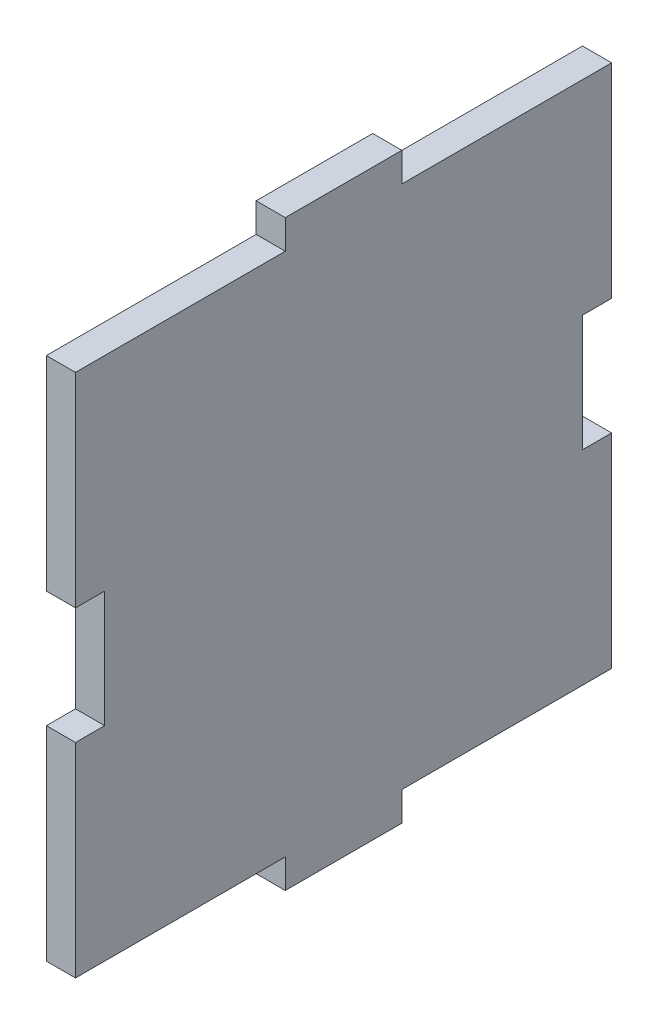
ISO-10303-21;
HEADER;
FILE_DESCRIPTION(('STEP AP214'),'2;1');
FILE_NAME('part.step','',(''),(''),'','','');
FILE_SCHEMA(('AUTOMOTIVE_DESIGN { 1 0 10303 214 1 1 1 1 }'));
ENDSEC;
DATA;
#1=APPLICATION_CONTEXT('core data for automotive mechanical design processes');
#2=APPLICATION_PROTOCOL_DEFINITION('international standard','automotive_design',2000,#1);
#3=PRODUCT_CONTEXT('',#1,'mechanical');
#4=PRODUCT('Part','Part','',(#3));
#5=PRODUCT_RELATED_PRODUCT_CATEGORY('part','',(#4));
#6=PRODUCT_DEFINITION_FORMATION('','',#4);
#7=PRODUCT_DEFINITION_CONTEXT('part definition',#1,'design');
#8=PRODUCT_DEFINITION('design','',#6,#7);
#9=PRODUCT_DEFINITION_SHAPE('','',#8);
#10=(LENGTH_UNIT() NAMED_UNIT(*) SI_UNIT(.MILLI.,.METRE.));
#11=(NAMED_UNIT(*) PLANE_ANGLE_UNIT() SI_UNIT($,.RADIAN.));
#12=(NAMED_UNIT(*) SI_UNIT($,.STERADIAN.) SOLID_ANGLE_UNIT());
#13=UNCERTAINTY_MEASURE_WITH_UNIT(LENGTH_MEASURE(1.E-05),#10,'distance_accuracy_value','');
#14=(GEOMETRIC_REPRESENTATION_CONTEXT(3) GLOBAL_UNCERTAINTY_ASSIGNED_CONTEXT((#13)) GLOBAL_UNIT_ASSIGNED_CONTEXT((#10,
#11,#12)) REPRESENTATION_CONTEXT('',''));
#15=CARTESIAN_POINT('',(0.,0.,0.));
#16=DIRECTION('',(0.,0.,1.));
#17=DIRECTION('',(1.,0.,0.));
#18=AXIS2_PLACEMENT_3D('',#15,#16,#17);
#19=CARTESIAN_POINT('',(3.175,6.35,29.21));
#20=DIRECTION('',(0.,0.,-1.));
#21=DIRECTION('',(-1.,0.,0.));
#22=AXIS2_PLACEMENT_3D('',#19,#20,#21);
#23=PLANE('',#22);
#24=DIRECTION('',(0.,-1.,0.));
#25=VECTOR('',#24,1.);
#26=CARTESIAN_POINT('',(0.,6.35,29.21));
#27=LINE('',#26,#25);
#28=CARTESIAN_POINT('',(0.,28.575,29.21));
#29=VERTEX_POINT('',#28);
#30=CARTESIAN_POINT('',(0.,6.35,29.21));
#31=VERTEX_POINT('',#30);
#32=EDGE_CURVE('E212',#29,#31,#27,.T.);
#33=ORIENTED_EDGE('',*,*,#32,.T.);
#34=DIRECTION('',(-1.,0.,0.));
#35=VECTOR('',#34,1.);
#36=CARTESIAN_POINT('',(3.175,6.35,29.21));
#37=LINE('',#36,#35);
#38=CARTESIAN_POINT('',(3.175,6.35,29.21));
#39=VERTEX_POINT('',#38);
#40=EDGE_CURVE('E11',#39,#31,#37,.T.);
#41=ORIENTED_EDGE('',*,*,#40,.F.);
#42=DIRECTION('',(0.,-1.,0.));
#43=VECTOR('',#42,1.);
#44=CARTESIAN_POINT('',(3.175,6.35,29.21));
#45=LINE('',#44,#43);
#46=CARTESIAN_POINT('',(3.175,28.575,29.21));
#47=VERTEX_POINT('',#46);
#48=EDGE_CURVE('E270',#47,#39,#45,.T.);
#49=ORIENTED_EDGE('',*,*,#48,.F.);
#50=DIRECTION('',(-1.,0.,0.));
#51=VECTOR('',#50,1.);
#52=CARTESIAN_POINT('',(3.175,28.575,29.21));
#53=LINE('',#52,#51);
#54=EDGE_CURVE('E208',#47,#29,#53,.T.);
#55=ORIENTED_EDGE('',*,*,#54,.T.);
#56=EDGE_LOOP('',(#33,#41,#49,#55));
#57=FACE_BOUND('',#56,.T.);
#58=ADVANCED_FACE('F39',(#57),#23,.F.);
#59=CARTESIAN_POINT('',(3.175,6.35,26.035));
#60=DIRECTION('',(0.,1.,0.));
#61=DIRECTION('',(0.,0.,1.));
#62=AXIS2_PLACEMENT_3D('',#59,#60,#61);
#63=PLANE('',#62);
#64=DIRECTION('',(0.,0.,-1.));
#65=VECTOR('',#64,1.);
#66=CARTESIAN_POINT('',(0.,6.35,26.035));
#67=LINE('',#66,#65);
#68=CARTESIAN_POINT('',(0.,6.35,26.035));
#69=VERTEX_POINT('',#68);
#70=EDGE_CURVE('E216',#31,#69,#67,.T.);
#71=ORIENTED_EDGE('',*,*,#70,.T.);
#72=DIRECTION('',(-1.,0.,0.));
#73=VECTOR('',#72,1.);
#74=CARTESIAN_POINT('',(3.175,6.35,26.035));
#75=LINE('',#74,#73);
#76=CARTESIAN_POINT('',(3.175,6.35,26.035));
#77=VERTEX_POINT('',#76);
#78=EDGE_CURVE('E48',#77,#69,#75,.T.);
#79=ORIENTED_EDGE('',*,*,#78,.F.);
#80=DIRECTION('',(0.,0.,-1.));
#81=VECTOR('',#80,1.);
#82=CARTESIAN_POINT('',(3.175,6.35,26.035));
#83=LINE('',#82,#81);
#84=EDGE_CURVE('E135',#39,#77,#83,.T.);
#85=ORIENTED_EDGE('',*,*,#84,.F.);
#86=ORIENTED_EDGE('',*,*,#40,.T.);
#87=EDGE_LOOP('',(#71,#79,#85,#86));
#88=FACE_BOUND('',#87,.T.);
#89=ADVANCED_FACE('F420',(#88),#63,.F.);
#90=CARTESIAN_POINT('',(3.175,-6.35,26.035));
#91=DIRECTION('',(0.,0.,-1.));
#92=DIRECTION('',(0.,1.,0.));
#93=AXIS2_PLACEMENT_3D('',#90,#91,#92);
#94=PLANE('',#93);
#95=DIRECTION('',(0.,-1.,0.));
#96=VECTOR('',#95,1.);
#97=CARTESIAN_POINT('',(0.,-6.35,26.035));
#98=LINE('',#97,#96);
#99=CARTESIAN_POINT('',(0.,-6.35,26.035));
#100=VERTEX_POINT('',#99);
#101=EDGE_CURVE('E219',#69,#100,#98,.T.);
#102=ORIENTED_EDGE('',*,*,#101,.T.);
#103=DIRECTION('',(-1.,0.,0.));
#104=VECTOR('',#103,1.);
#105=CARTESIAN_POINT('',(3.175,-6.35,26.035));
#106=LINE('',#105,#104);
#107=CARTESIAN_POINT('',(3.175,-6.35,26.035));
#108=VERTEX_POINT('',#107);
#109=EDGE_CURVE('E329',#108,#100,#106,.T.);
#110=ORIENTED_EDGE('',*,*,#109,.F.);
#111=DIRECTION('',(0.,-1.,0.));
#112=VECTOR('',#111,1.);
#113=CARTESIAN_POINT('',(3.175,-6.35,26.035));
#114=LINE('',#113,#112);
#115=EDGE_CURVE('E339',#77,#108,#114,.T.);
#116=ORIENTED_EDGE('',*,*,#115,.F.);
#117=ORIENTED_EDGE('',*,*,#78,.T.);
#118=EDGE_LOOP('',(#102,#110,#116,#117));
#119=FACE_BOUND('',#118,.T.);
#120=ADVANCED_FACE('F337',(#119),#94,.F.);
#121=CARTESIAN_POINT('',(3.175,-6.35,29.21));
#122=DIRECTION('',(0.,-1.,0.));
#123=DIRECTION('',(0.,0.,-1.));
#124=AXIS2_PLACEMENT_3D('',#121,#122,#123);
#125=PLANE('',#124);
#126=DIRECTION('',(0.,0.,1.));
#127=VECTOR('',#126,1.);
#128=CARTESIAN_POINT('',(0.,-6.35,29.21));
#129=LINE('',#128,#127);
#130=CARTESIAN_POINT('',(0.,-6.35,29.21));
#131=VERTEX_POINT('',#130);
#132=EDGE_CURVE('E222',#100,#131,#129,.T.);
#133=ORIENTED_EDGE('',*,*,#132,.T.);
#134=DIRECTION('',(-1.,0.,0.));
#135=VECTOR('',#134,1.);
#136=CARTESIAN_POINT('',(3.175,-6.35,29.21));
#137=LINE('',#136,#135);
#138=CARTESIAN_POINT('',(3.175,-6.35,29.21));
#139=VERTEX_POINT('',#138);
#140=EDGE_CURVE('E325',#139,#131,#137,.T.);
#141=ORIENTED_EDGE('',*,*,#140,.F.);
#142=DIRECTION('',(0.,0.,1.));
#143=VECTOR('',#142,1.);
#144=CARTESIAN_POINT('',(3.175,-6.35,29.21));
#145=LINE('',#144,#143);
#146=EDGE_CURVE('E358',#108,#139,#145,.T.);
#147=ORIENTED_EDGE('',*,*,#146,.F.);
#148=ORIENTED_EDGE('',*,*,#109,.T.);
#149=EDGE_LOOP('',(#133,#141,#147,#148));
#150=FACE_BOUND('',#149,.T.);
#151=ADVANCED_FACE('F348',(#150),#125,.F.);
#152=CARTESIAN_POINT('',(3.175,-28.575,29.21));
#153=DIRECTION('',(0.,0.,-1.));
#154=DIRECTION('',(-1.,0.,0.));
#155=AXIS2_PLACEMENT_3D('',#152,#153,#154);
#156=PLANE('',#155);
#157=DIRECTION('',(0.,-1.,0.));
#158=VECTOR('',#157,1.);
#159=CARTESIAN_POINT('',(0.,-28.575,29.21));
#160=LINE('',#159,#158);
#161=CARTESIAN_POINT('',(0.,-28.575,29.21));
#162=VERTEX_POINT('',#161);
#163=EDGE_CURVE('E225',#131,#162,#160,.T.);
#164=ORIENTED_EDGE('',*,*,#163,.T.);
#165=DIRECTION('',(-1.,0.,0.));
#166=VECTOR('',#165,1.);
#167=CARTESIAN_POINT('',(3.175,-28.575,29.21));
#168=LINE('',#167,#166);
#169=CARTESIAN_POINT('',(3.175,-28.575,29.21));
#170=VERTEX_POINT('',#169);
#171=EDGE_CURVE('E321',#170,#162,#168,.T.);
#172=ORIENTED_EDGE('',*,*,#171,.F.);
#173=DIRECTION('',(0.,-1.,0.));
#174=VECTOR('',#173,1.);
#175=CARTESIAN_POINT('',(3.175,-28.575,29.21));
#176=LINE('',#175,#174);
#177=EDGE_CURVE('E354',#139,#170,#176,.T.);
#178=ORIENTED_EDGE('',*,*,#177,.F.);
#179=ORIENTED_EDGE('',*,*,#140,.T.);
#180=EDGE_LOOP('',(#164,#172,#178,#179));
#181=FACE_BOUND('',#180,.T.);
#182=ADVANCED_FACE('F352',(#181),#156,.F.);
#183=CARTESIAN_POINT('',(3.175,-28.575,6.35000000000001));
#184=DIRECTION('',(0.,1.,0.));
#185=DIRECTION('',(0.,0.,1.));
#186=AXIS2_PLACEMENT_3D('',#183,#184,#185);
#187=PLANE('',#186);
#188=DIRECTION('',(0.,0.,-1.));
#189=VECTOR('',#188,1.);
#190=CARTESIAN_POINT('',(0.,-28.575,6.35000000000001));
#191=LINE('',#190,#189);
#192=CARTESIAN_POINT('',(0.,-28.575,6.35000000000001));
#193=VERTEX_POINT('',#192);
#194=EDGE_CURVE('E228',#162,#193,#191,.T.);
#195=ORIENTED_EDGE('',*,*,#194,.T.);
#196=DIRECTION('',(-1.,0.,0.));
#197=VECTOR('',#196,1.);
#198=CARTESIAN_POINT('',(3.175,-28.575,6.35000000000001));
#199=LINE('',#198,#197);
#200=CARTESIAN_POINT('',(3.175,-28.575,6.35000000000001));
#201=VERTEX_POINT('',#200);
#202=EDGE_CURVE('E317',#201,#193,#199,.T.);
#203=ORIENTED_EDGE('',*,*,#202,.F.);
#204=DIRECTION('',(0.,0.,-1.));
#205=VECTOR('',#204,1.);
#206=CARTESIAN_POINT('',(3.175,-28.575,6.35000000000001));
#207=LINE('',#206,#205);
#208=EDGE_CURVE('E357',#170,#201,#207,.T.);
#209=ORIENTED_EDGE('',*,*,#208,.F.);
#210=ORIENTED_EDGE('',*,*,#171,.T.);
#211=EDGE_LOOP('',(#195,#203,#209,#210));
#212=FACE_BOUND('',#211,.T.);
#213=ADVANCED_FACE('F433',(#212),#187,.F.);
#214=CARTESIAN_POINT('',(3.175,-31.75,6.35));
#215=DIRECTION('',(0.,0.,-1.));
#216=DIRECTION('',(0.,1.,0.));
#217=AXIS2_PLACEMENT_3D('',#214,#215,#216);
#218=PLANE('',#217);
#219=DIRECTION('',(0.,-1.,0.));
#220=VECTOR('',#219,1.);
#221=CARTESIAN_POINT('',(0.,-31.75,6.35));
#222=LINE('',#221,#220);
#223=CARTESIAN_POINT('',(0.,-31.75,6.35));
#224=VERTEX_POINT('',#223);
#225=EDGE_CURVE('E231',#193,#224,#222,.T.);
#226=ORIENTED_EDGE('',*,*,#225,.T.);
#227=DIRECTION('',(-1.,0.,0.));
#228=VECTOR('',#227,1.);
#229=CARTESIAN_POINT('',(3.175,-31.75,6.35));
#230=LINE('',#229,#228);
#231=CARTESIAN_POINT('',(3.175,-31.75,6.35));
#232=VERTEX_POINT('',#231);
#233=EDGE_CURVE('E313',#232,#224,#230,.T.);
#234=ORIENTED_EDGE('',*,*,#233,.F.);
#235=DIRECTION('',(0.,-1.,0.));
#236=VECTOR('',#235,1.);
#237=CARTESIAN_POINT('',(3.175,-31.75,6.35));
#238=LINE('',#237,#236);
#239=EDGE_CURVE('E362',#201,#232,#238,.T.);
#240=ORIENTED_EDGE('',*,*,#239,.F.);
#241=ORIENTED_EDGE('',*,*,#202,.T.);
#242=EDGE_LOOP('',(#226,#234,#240,#241));
#243=FACE_BOUND('',#242,.T.);
#244=ADVANCED_FACE('F436',(#243),#218,.F.);
#245=CARTESIAN_POINT('',(3.175,-31.75,-6.35));
#246=DIRECTION('',(0.,1.,0.));
#247=DIRECTION('',(0.,0.,1.));
#248=AXIS2_PLACEMENT_3D('',#245,#246,#247);
#249=PLANE('',#248);
#250=DIRECTION('',(0.,0.,-1.));
#251=VECTOR('',#250,1.);
#252=CARTESIAN_POINT('',(0.,-31.75,-6.35));
#253=LINE('',#252,#251);
#254=CARTESIAN_POINT('',(0.,-31.75,-6.35));
#255=VERTEX_POINT('',#254);
#256=EDGE_CURVE('E234',#224,#255,#253,.T.);
#257=ORIENTED_EDGE('',*,*,#256,.T.);
#258=DIRECTION('',(-1.,0.,0.));
#259=VECTOR('',#258,1.);
#260=CARTESIAN_POINT('',(3.175,-31.75,-6.35));
#261=LINE('',#260,#259);
#262=CARTESIAN_POINT('',(3.175,-31.75,-6.35));
#263=VERTEX_POINT('',#262);
#264=EDGE_CURVE('E309',#263,#255,#261,.T.);
#265=ORIENTED_EDGE('',*,*,#264,.F.);
#266=DIRECTION('',(0.,0.,-1.));
#267=VECTOR('',#266,1.);
#268=CARTESIAN_POINT('',(3.175,-31.75,-6.35));
#269=LINE('',#268,#267);
#270=EDGE_CURVE('E369',#232,#263,#269,.T.);
#271=ORIENTED_EDGE('',*,*,#270,.F.);
#272=ORIENTED_EDGE('',*,*,#233,.T.);
#273=EDGE_LOOP('',(#257,#265,#271,#272));
#274=FACE_BOUND('',#273,.T.);
#275=ADVANCED_FACE('F440',(#274),#249,.F.);
#276=CARTESIAN_POINT('',(3.175,-28.575,-6.35000000000001));
#277=DIRECTION('',(0.,0.,1.));
#278=DIRECTION('',(0.,-1.,0.));
#279=AXIS2_PLACEMENT_3D('',#276,#277,#278);
#280=PLANE('',#279);
#281=DIRECTION('',(0.,1.,0.));
#282=VECTOR('',#281,1.);
#283=CARTESIAN_POINT('',(0.,-28.575,-6.35000000000001));
#284=LINE('',#283,#282);
#285=CARTESIAN_POINT('',(0.,-28.575,-6.35000000000001));
#286=VERTEX_POINT('',#285);
#287=EDGE_CURVE('E237',#255,#286,#284,.T.);
#288=ORIENTED_EDGE('',*,*,#287,.T.);
#289=DIRECTION('',(-1.,0.,0.));
#290=VECTOR('',#289,1.);
#291=CARTESIAN_POINT('',(3.175,-28.575,-6.35000000000001));
#292=LINE('',#291,#290);
#293=CARTESIAN_POINT('',(3.175,-28.575,-6.35000000000001));
#294=VERTEX_POINT('',#293);
#295=EDGE_CURVE('E305',#294,#286,#292,.T.);
#296=ORIENTED_EDGE('',*,*,#295,.F.);
#297=DIRECTION('',(0.,1.,0.));
#298=VECTOR('',#297,1.);
#299=CARTESIAN_POINT('',(3.175,-28.575,-6.35000000000001));
#300=LINE('',#299,#298);
#301=EDGE_CURVE('E372',#263,#294,#300,.T.);
#302=ORIENTED_EDGE('',*,*,#301,.F.);
#303=ORIENTED_EDGE('',*,*,#264,.T.);
#304=EDGE_LOOP('',(#288,#296,#302,#303));
#305=FACE_BOUND('',#304,.T.);
#306=ADVANCED_FACE('F444',(#305),#280,.F.);
#307=CARTESIAN_POINT('',(3.175,-28.575,-29.21));
#308=DIRECTION('',(0.,1.,0.));
#309=DIRECTION('',(0.,0.,1.));
#310=AXIS2_PLACEMENT_3D('',#307,#308,#309);
#311=PLANE('',#310);
#312=DIRECTION('',(0.,0.,-1.));
#313=VECTOR('',#312,1.);
#314=CARTESIAN_POINT('',(0.,-28.575,-29.21));
#315=LINE('',#314,#313);
#316=CARTESIAN_POINT('',(0.,-28.575,-29.21));
#317=VERTEX_POINT('',#316);
#318=EDGE_CURVE('E240',#286,#317,#315,.T.);
#319=ORIENTED_EDGE('',*,*,#318,.T.);
#320=DIRECTION('',(-1.,0.,0.));
#321=VECTOR('',#320,1.);
#322=CARTESIAN_POINT('',(3.175,-28.575,-29.21));
#323=LINE('',#322,#321);
#324=CARTESIAN_POINT('',(3.175,-28.575,-29.21));
#325=VERTEX_POINT('',#324);
#326=EDGE_CURVE('E301',#325,#317,#323,.T.);
#327=ORIENTED_EDGE('',*,*,#326,.F.);
#328=DIRECTION('',(0.,0.,-1.));
#329=VECTOR('',#328,1.);
#330=CARTESIAN_POINT('',(3.175,-28.575,-29.21));
#331=LINE('',#330,#329);
#332=EDGE_CURVE('E375',#294,#325,#331,.T.);
#333=ORIENTED_EDGE('',*,*,#332,.F.);
#334=ORIENTED_EDGE('',*,*,#295,.T.);
#335=EDGE_LOOP('',(#319,#327,#333,#334));
#336=FACE_BOUND('',#335,.T.);
#337=ADVANCED_FACE('F448',(#336),#311,.F.);
#338=CARTESIAN_POINT('',(3.175,-6.35,-29.21));
#339=DIRECTION('',(0.,0.,1.));
#340=DIRECTION('',(1.,0.,0.));
#341=AXIS2_PLACEMENT_3D('',#338,#339,#340);
#342=PLANE('',#341);
#343=DIRECTION('',(0.,1.,0.));
#344=VECTOR('',#343,1.);
#345=CARTESIAN_POINT('',(0.,-6.35,-29.21));
#346=LINE('',#345,#344);
#347=CARTESIAN_POINT('',(0.,-6.35,-29.21));
#348=VERTEX_POINT('',#347);
#349=EDGE_CURVE('E243',#317,#348,#346,.T.);
#350=ORIENTED_EDGE('',*,*,#349,.T.);
#351=DIRECTION('',(-1.,0.,0.));
#352=VECTOR('',#351,1.);
#353=CARTESIAN_POINT('',(3.175,-6.35,-29.21));
#354=LINE('',#353,#352);
#355=CARTESIAN_POINT('',(3.175,-6.35,-29.21));
#356=VERTEX_POINT('',#355);
#357=EDGE_CURVE('E297',#356,#348,#354,.T.);
#358=ORIENTED_EDGE('',*,*,#357,.F.);
#359=DIRECTION('',(0.,1.,0.));
#360=VECTOR('',#359,1.);
#361=CARTESIAN_POINT('',(3.175,-6.35,-29.21));
#362=LINE('',#361,#360);
#363=EDGE_CURVE('E378',#325,#356,#362,.T.);
#364=ORIENTED_EDGE('',*,*,#363,.F.);
#365=ORIENTED_EDGE('',*,*,#326,.T.);
#366=EDGE_LOOP('',(#350,#358,#364,#365));
#367=FACE_BOUND('',#366,.T.);
#368=ADVANCED_FACE('F452',(#367),#342,.F.);
#369=CARTESIAN_POINT('',(3.175,-6.35,-26.035));
#370=DIRECTION('',(0.,-1.,0.));
#371=DIRECTION('',(0.,0.,-1.));
#372=AXIS2_PLACEMENT_3D('',#369,#370,#371);
#373=PLANE('',#372);
#374=DIRECTION('',(0.,0.,1.));
#375=VECTOR('',#374,1.);
#376=CARTESIAN_POINT('',(0.,-6.35,-26.035));
#377=LINE('',#376,#375);
#378=CARTESIAN_POINT('',(0.,-6.35,-26.035));
#379=VERTEX_POINT('',#378);
#380=EDGE_CURVE('E246',#348,#379,#377,.T.);
#381=ORIENTED_EDGE('',*,*,#380,.T.);
#382=DIRECTION('',(-1.,0.,0.));
#383=VECTOR('',#382,1.);
#384=CARTESIAN_POINT('',(3.175,-6.35,-26.035));
#385=LINE('',#384,#383);
#386=CARTESIAN_POINT('',(3.175,-6.35,-26.035));
#387=VERTEX_POINT('',#386);
#388=EDGE_CURVE('E293',#387,#379,#385,.T.);
#389=ORIENTED_EDGE('',*,*,#388,.F.);
#390=DIRECTION('',(0.,0.,1.));
#391=VECTOR('',#390,1.);
#392=CARTESIAN_POINT('',(3.175,-6.35,-26.035));
#393=LINE('',#392,#391);
#394=EDGE_CURVE('E381',#356,#387,#393,.T.);
#395=ORIENTED_EDGE('',*,*,#394,.F.);
#396=ORIENTED_EDGE('',*,*,#357,.T.);
#397=EDGE_LOOP('',(#381,#389,#395,#396));
#398=FACE_BOUND('',#397,.T.);
#399=ADVANCED_FACE('F456',(#398),#373,.F.);
#400=CARTESIAN_POINT('',(3.175,6.35,-26.035));
#401=DIRECTION('',(0.,0.,1.));
#402=DIRECTION('',(0.,-1.,0.));
#403=AXIS2_PLACEMENT_3D('',#400,#401,#402);
#404=PLANE('',#403);
#405=DIRECTION('',(0.,1.,0.));
#406=VECTOR('',#405,1.);
#407=CARTESIAN_POINT('',(0.,6.35,-26.035));
#408=LINE('',#407,#406);
#409=CARTESIAN_POINT('',(0.,6.35,-26.035));
#410=VERTEX_POINT('',#409);
#411=EDGE_CURVE('E249',#379,#410,#408,.T.);
#412=ORIENTED_EDGE('',*,*,#411,.T.);
#413=DIRECTION('',(-1.,0.,0.));
#414=VECTOR('',#413,1.);
#415=CARTESIAN_POINT('',(3.175,6.35,-26.035));
#416=LINE('',#415,#414);
#417=CARTESIAN_POINT('',(3.175,6.35,-26.035));
#418=VERTEX_POINT('',#417);
#419=EDGE_CURVE('E289',#418,#410,#416,.T.);
#420=ORIENTED_EDGE('',*,*,#419,.F.);
#421=DIRECTION('',(0.,1.,0.));
#422=VECTOR('',#421,1.);
#423=CARTESIAN_POINT('',(3.175,6.35,-26.035));
#424=LINE('',#423,#422);
#425=EDGE_CURVE('E384',#387,#418,#424,.T.);
#426=ORIENTED_EDGE('',*,*,#425,.F.);
#427=ORIENTED_EDGE('',*,*,#388,.T.);
#428=EDGE_LOOP('',(#412,#420,#426,#427));
#429=FACE_BOUND('',#428,.T.);
#430=ADVANCED_FACE('F460',(#429),#404,.F.);
#431=CARTESIAN_POINT('',(3.175,6.35,-29.21));
#432=DIRECTION('',(0.,1.,0.));
#433=DIRECTION('',(0.,0.,1.));
#434=AXIS2_PLACEMENT_3D('',#431,#432,#433);
#435=PLANE('',#434);
#436=DIRECTION('',(0.,0.,-1.));
#437=VECTOR('',#436,1.);
#438=CARTESIAN_POINT('',(0.,6.35,-29.21));
#439=LINE('',#438,#437);
#440=CARTESIAN_POINT('',(0.,6.35,-29.21));
#441=VERTEX_POINT('',#440);
#442=EDGE_CURVE('E252',#410,#441,#439,.T.);
#443=ORIENTED_EDGE('',*,*,#442,.T.);
#444=DIRECTION('',(-1.,0.,0.));
#445=VECTOR('',#444,1.);
#446=CARTESIAN_POINT('',(3.175,6.35,-29.21));
#447=LINE('',#446,#445);
#448=CARTESIAN_POINT('',(3.175,6.35,-29.21));
#449=VERTEX_POINT('',#448);
#450=EDGE_CURVE('E285',#449,#441,#447,.T.);
#451=ORIENTED_EDGE('',*,*,#450,.F.);
#452=DIRECTION('',(0.,0.,-1.));
#453=VECTOR('',#452,1.);
#454=CARTESIAN_POINT('',(3.175,6.35,-29.21));
#455=LINE('',#454,#453);
#456=EDGE_CURVE('E387',#418,#449,#455,.T.);
#457=ORIENTED_EDGE('',*,*,#456,.F.);
#458=ORIENTED_EDGE('',*,*,#419,.T.);
#459=EDGE_LOOP('',(#443,#451,#457,#458));
#460=FACE_BOUND('',#459,.T.);
#461=ADVANCED_FACE('F464',(#460),#435,.F.);
#462=CARTESIAN_POINT('',(3.175,28.575,-29.21));
#463=DIRECTION('',(0.,0.,1.));
#464=DIRECTION('',(1.,0.,0.));
#465=AXIS2_PLACEMENT_3D('',#462,#463,#464);
#466=PLANE('',#465);
#467=DIRECTION('',(0.,1.,0.));
#468=VECTOR('',#467,1.);
#469=CARTESIAN_POINT('',(0.,28.575,-29.21));
#470=LINE('',#469,#468);
#471=CARTESIAN_POINT('',(0.,28.575,-29.21));
#472=VERTEX_POINT('',#471);
#473=EDGE_CURVE('E255',#441,#472,#470,.T.);
#474=ORIENTED_EDGE('',*,*,#473,.T.);
#475=DIRECTION('',(-1.,0.,0.));
#476=VECTOR('',#475,1.);
#477=CARTESIAN_POINT('',(3.175,28.575,-29.21));
#478=LINE('',#477,#476);
#479=CARTESIAN_POINT('',(3.175,28.575,-29.21));
#480=VERTEX_POINT('',#479);
#481=EDGE_CURVE('E281',#480,#472,#478,.T.);
#482=ORIENTED_EDGE('',*,*,#481,.F.);
#483=DIRECTION('',(0.,1.,0.));
#484=VECTOR('',#483,1.);
#485=CARTESIAN_POINT('',(3.175,28.575,-29.21));
#486=LINE('',#485,#484);
#487=EDGE_CURVE('E390',#449,#480,#486,.T.);
#488=ORIENTED_EDGE('',*,*,#487,.F.);
#489=ORIENTED_EDGE('',*,*,#450,.T.);
#490=EDGE_LOOP('',(#474,#482,#488,#489));
#491=FACE_BOUND('',#490,.T.);
#492=ADVANCED_FACE('F468',(#491),#466,.F.);
#493=CARTESIAN_POINT('',(3.175,28.575,-6.35000000000001));
#494=DIRECTION('',(0.,-1.,0.));
#495=DIRECTION('',(0.,0.,-1.));
#496=AXIS2_PLACEMENT_3D('',#493,#494,#495);
#497=PLANE('',#496);
#498=DIRECTION('',(0.,0.,1.));
#499=VECTOR('',#498,1.);
#500=CARTESIAN_POINT('',(0.,28.575,-6.35000000000001));
#501=LINE('',#500,#499);
#502=CARTESIAN_POINT('',(0.,28.575,-6.35000000000001));
#503=VERTEX_POINT('',#502);
#504=EDGE_CURVE('E258',#472,#503,#501,.T.);
#505=ORIENTED_EDGE('',*,*,#504,.T.);
#506=DIRECTION('',(-1.,0.,0.));
#507=VECTOR('',#506,1.);
#508=CARTESIAN_POINT('',(3.175,28.575,-6.35000000000001));
#509=LINE('',#508,#507);
#510=CARTESIAN_POINT('',(3.175,28.575,-6.35000000000001));
#511=VERTEX_POINT('',#510);
#512=EDGE_CURVE('E277',#511,#503,#509,.T.);
#513=ORIENTED_EDGE('',*,*,#512,.F.);
#514=DIRECTION('',(0.,0.,1.));
#515=VECTOR('',#514,1.);
#516=CARTESIAN_POINT('',(3.175,28.575,-6.35000000000001));
#517=LINE('',#516,#515);
#518=EDGE_CURVE('E393',#480,#511,#517,.T.);
#519=ORIENTED_EDGE('',*,*,#518,.F.);
#520=ORIENTED_EDGE('',*,*,#481,.T.);
#521=EDGE_LOOP('',(#505,#513,#519,#520));
#522=FACE_BOUND('',#521,.T.);
#523=ADVANCED_FACE('F401',(#522),#497,.F.);
#524=CARTESIAN_POINT('',(3.175,31.75,-6.35));
#525=DIRECTION('',(0.,0.,1.));
#526=DIRECTION('',(0.,-1.,0.));
#527=AXIS2_PLACEMENT_3D('',#524,#525,#526);
#528=PLANE('',#527);
#529=DIRECTION('',(0.,1.,0.));
#530=VECTOR('',#529,1.);
#531=CARTESIAN_POINT('',(0.,31.75,-6.35));
#532=LINE('',#531,#530);
#533=CARTESIAN_POINT('',(0.,31.75,-6.35));
#534=VERTEX_POINT('',#533);
#535=EDGE_CURVE('E261',#503,#534,#532,.T.);
#536=ORIENTED_EDGE('',*,*,#535,.T.);
#537=DIRECTION('',(-1.,0.,0.));
#538=VECTOR('',#537,1.);
#539=CARTESIAN_POINT('',(3.175,31.75,-6.35));
#540=LINE('',#539,#538);
#541=CARTESIAN_POINT('',(3.175,31.75,-6.35));
#542=VERTEX_POINT('',#541);
#543=EDGE_CURVE('E201',#542,#534,#540,.T.);
#544=ORIENTED_EDGE('',*,*,#543,.F.);
#545=DIRECTION('',(0.,1.,0.));
#546=VECTOR('',#545,1.);
#547=CARTESIAN_POINT('',(3.175,31.75,-6.35));
#548=LINE('',#547,#546);
#549=EDGE_CURVE('E190',#511,#542,#548,.T.);
#550=ORIENTED_EDGE('',*,*,#549,.F.);
#551=ORIENTED_EDGE('',*,*,#512,.T.);
#552=EDGE_LOOP('',(#536,#544,#550,#551));
#553=FACE_BOUND('',#552,.T.);
#554=ADVANCED_FACE('F405',(#553),#528,.F.);
#555=CARTESIAN_POINT('',(3.175,31.75,6.35));
#556=DIRECTION('',(0.,-1.,0.));
#557=DIRECTION('',(0.,0.,-1.));
#558=AXIS2_PLACEMENT_3D('',#555,#556,#557);
#559=PLANE('',#558);
#560=DIRECTION('',(0.,0.,1.));
#561=VECTOR('',#560,1.);
#562=CARTESIAN_POINT('',(0.,31.75,6.35));
#563=LINE('',#562,#561);
#564=CARTESIAN_POINT('',(0.,31.75,6.35));
#565=VERTEX_POINT('',#564);
#566=EDGE_CURVE('E199',#534,#565,#563,.T.);
#567=ORIENTED_EDGE('',*,*,#566,.T.);
#568=DIRECTION('',(-1.,0.,0.));
#569=VECTOR('',#568,1.);
#570=CARTESIAN_POINT('',(3.175,31.75,6.35));
#571=LINE('',#570,#569);
#572=CARTESIAN_POINT('',(3.175,31.75,6.35));
#573=VERTEX_POINT('',#572);
#574=EDGE_CURVE('E196',#573,#565,#571,.T.);
#575=ORIENTED_EDGE('',*,*,#574,.F.);
#576=DIRECTION('',(0.,0.,1.));
#577=VECTOR('',#576,1.);
#578=CARTESIAN_POINT('',(3.175,31.75,6.35));
#579=LINE('',#578,#577);
#580=EDGE_CURVE('E184',#542,#573,#579,.T.);
#581=ORIENTED_EDGE('',*,*,#580,.F.);
#582=ORIENTED_EDGE('',*,*,#543,.T.);
#583=EDGE_LOOP('',(#567,#575,#581,#582));
#584=FACE_BOUND('',#583,.T.);
#585=ADVANCED_FACE('F197',(#584),#559,.F.);
#586=CARTESIAN_POINT('',(3.175,28.575,6.35000000000001));
#587=DIRECTION('',(0.,0.,-1.));
#588=DIRECTION('',(0.,1.,0.));
#589=AXIS2_PLACEMENT_3D('',#586,#587,#588);
#590=PLANE('',#589);
#591=DIRECTION('',(0.,-1.,0.));
#592=VECTOR('',#591,1.);
#593=CARTESIAN_POINT('',(0.,28.575,6.35000000000001));
#594=LINE('',#593,#592);
#595=CARTESIAN_POINT('',(0.,28.575,6.35000000000001));
#596=VERTEX_POINT('',#595);
#597=EDGE_CURVE('E121',#565,#596,#594,.T.);
#598=ORIENTED_EDGE('',*,*,#597,.T.);
#599=DIRECTION('',(-1.,0.,0.));
#600=VECTOR('',#599,1.);
#601=CARTESIAN_POINT('',(3.175,28.575,6.35000000000001));
#602=LINE('',#601,#600);
#603=CARTESIAN_POINT('',(3.175,28.575,6.35000000000001));
#604=VERTEX_POINT('',#603);
#605=EDGE_CURVE('E202',#604,#596,#602,.T.);
#606=ORIENTED_EDGE('',*,*,#605,.F.);
#607=DIRECTION('',(0.,-1.,0.));
#608=VECTOR('',#607,1.);
#609=CARTESIAN_POINT('',(3.175,28.575,6.35000000000001));
#610=LINE('',#609,#608);
#611=EDGE_CURVE('E188',#573,#604,#610,.T.);
#612=ORIENTED_EDGE('',*,*,#611,.F.);
#613=ORIENTED_EDGE('',*,*,#574,.T.);
#614=EDGE_LOOP('',(#598,#606,#612,#613));
#615=FACE_BOUND('',#614,.T.);
#616=ADVANCED_FACE('F204',(#615),#590,.F.);
#617=CARTESIAN_POINT('',(3.175,28.575,29.21));
#618=DIRECTION('',(0.,-1.,0.));
#619=DIRECTION('',(0.,0.,-1.));
#620=AXIS2_PLACEMENT_3D('',#617,#618,#619);
#621=PLANE('',#620);
#622=DIRECTION('',(0.,0.,1.));
#623=VECTOR('',#622,1.);
#624=CARTESIAN_POINT('',(0.,28.575,29.21));
#625=LINE('',#624,#623);
#626=EDGE_CURVE('E127',#596,#29,#625,.T.);
#627=ORIENTED_EDGE('',*,*,#626,.T.);
#628=ORIENTED_EDGE('',*,*,#54,.F.);
#629=DIRECTION('',(0.,0.,1.));
#630=VECTOR('',#629,1.);
#631=CARTESIAN_POINT('',(3.175,28.575,29.21));
#632=LINE('',#631,#630);
#633=EDGE_CURVE('E56',#604,#47,#632,.T.);
#634=ORIENTED_EDGE('',*,*,#633,.F.);
#635=ORIENTED_EDGE('',*,*,#605,.T.);
#636=EDGE_LOOP('',(#627,#628,#634,#635));
#637=FACE_BOUND('',#636,.T.);
#638=ADVANCED_FACE('F409',(#637),#621,.F.);
#639=CARTESIAN_POINT('',(3.175,0.,0.));
#640=DIRECTION('',(-1.,0.,0.));
#641=DIRECTION('',(0.,0.,1.));
#642=AXIS2_PLACEMENT_3D('',#639,#640,#641);
#643=PLANE('',#642);
#644=ORIENTED_EDGE('',*,*,#48,.T.);
#645=ORIENTED_EDGE('',*,*,#84,.T.);
#646=ORIENTED_EDGE('',*,*,#115,.T.);
#647=ORIENTED_EDGE('',*,*,#146,.T.);
#648=ORIENTED_EDGE('',*,*,#177,.T.);
#649=ORIENTED_EDGE('',*,*,#208,.T.);
#650=ORIENTED_EDGE('',*,*,#239,.T.);
#651=ORIENTED_EDGE('',*,*,#270,.T.);
#652=ORIENTED_EDGE('',*,*,#301,.T.);
#653=ORIENTED_EDGE('',*,*,#332,.T.);
#654=ORIENTED_EDGE('',*,*,#363,.T.);
#655=ORIENTED_EDGE('',*,*,#394,.T.);
#656=ORIENTED_EDGE('',*,*,#425,.T.);
#657=ORIENTED_EDGE('',*,*,#456,.T.);
#658=ORIENTED_EDGE('',*,*,#487,.T.);
#659=ORIENTED_EDGE('',*,*,#518,.T.);
#660=ORIENTED_EDGE('',*,*,#549,.T.);
#661=ORIENTED_EDGE('',*,*,#580,.T.);
#662=ORIENTED_EDGE('',*,*,#611,.T.);
#663=ORIENTED_EDGE('',*,*,#633,.T.);
#664=EDGE_LOOP('',(#644,#645,#646,#647,#648,#649,#650,#651,#652,#653,#654,#655,#656,#657,#658,
#659,#660,#661,#662,#663));
#665=FACE_BOUND('',#664,.T.);
#666=ADVANCED_FACE('F186',(#665),#643,.F.);
#667=CARTESIAN_POINT('',(0.,0.,0.));
#668=DIRECTION('',(-1.,0.,0.));
#669=DIRECTION('',(0.,0.,1.));
#670=AXIS2_PLACEMENT_3D('',#667,#668,#669);
#671=PLANE('',#670);
#672=ORIENTED_EDGE('',*,*,#32,.F.);
#673=ORIENTED_EDGE('',*,*,#626,.F.);
#674=ORIENTED_EDGE('',*,*,#597,.F.);
#675=ORIENTED_EDGE('',*,*,#566,.F.);
#676=ORIENTED_EDGE('',*,*,#535,.F.);
#677=ORIENTED_EDGE('',*,*,#504,.F.);
#678=ORIENTED_EDGE('',*,*,#473,.F.);
#679=ORIENTED_EDGE('',*,*,#442,.F.);
#680=ORIENTED_EDGE('',*,*,#411,.F.);
#681=ORIENTED_EDGE('',*,*,#380,.F.);
#682=ORIENTED_EDGE('',*,*,#349,.F.);
#683=ORIENTED_EDGE('',*,*,#318,.F.);
#684=ORIENTED_EDGE('',*,*,#287,.F.);
#685=ORIENTED_EDGE('',*,*,#256,.F.);
#686=ORIENTED_EDGE('',*,*,#225,.F.);
#687=ORIENTED_EDGE('',*,*,#194,.F.);
#688=ORIENTED_EDGE('',*,*,#163,.F.);
#689=ORIENTED_EDGE('',*,*,#132,.F.);
#690=ORIENTED_EDGE('',*,*,#101,.F.);
#691=ORIENTED_EDGE('',*,*,#70,.F.);
#692=EDGE_LOOP('',(#672,#673,#674,#675,#676,#677,#678,#679,#680,#681,#682,#683,#684,#685,#686,
#687,#688,#689,#690,#691));
#693=FACE_BOUND('',#692,.T.);
#694=ADVANCED_FACE('F343',(#693),#671,.T.);
#695=CLOSED_SHELL('',(#58,#89,#120,#151,#182,#213,#244,#275,#306,#337,#368,#399,#430,#461,#492,
#523,#554,#585,#616,#638,#666,#694));
#696=MANIFOLD_SOLID_BREP('B2',#695);
#697=ADVANCED_BREP_SHAPE_REPRESENTATION('',(#18,#696),#14);
#698=SHAPE_DEFINITION_REPRESENTATION(#9,#697);
ENDSEC;
END-ISO-10303-21;
